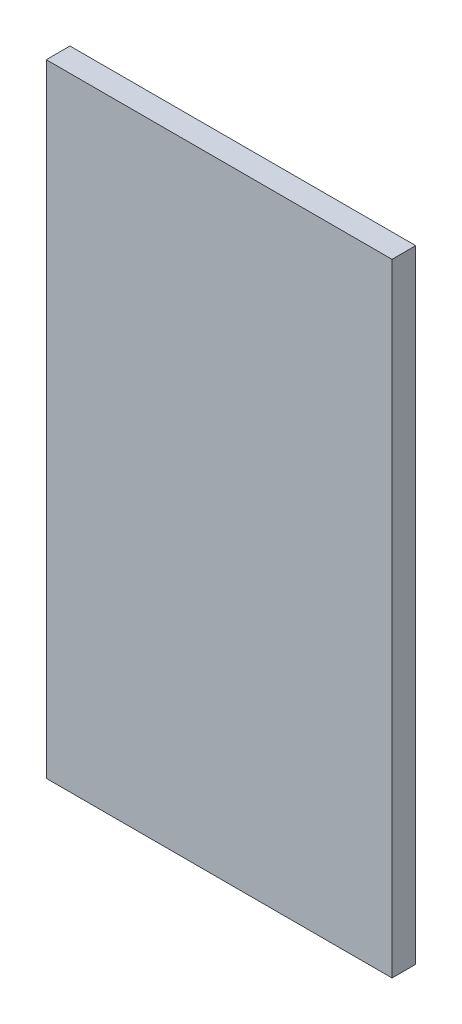
ISO-10303-21;
HEADER;
FILE_DESCRIPTION(('STEP AP214'),'2;1');
FILE_NAME('part.step','',(''),(''),'','','');
FILE_SCHEMA(('AUTOMOTIVE_DESIGN { 1 0 10303 214 1 1 1 1 }'));
ENDSEC;
DATA;
#1=APPLICATION_CONTEXT('core data for automotive mechanical design processes');
#2=APPLICATION_PROTOCOL_DEFINITION('international standard','automotive_design',2000,#1);
#3=PRODUCT_CONTEXT('',#1,'mechanical');
#4=PRODUCT('Part','Part','',(#3));
#5=PRODUCT_RELATED_PRODUCT_CATEGORY('part','',(#4));
#6=PRODUCT_DEFINITION_FORMATION('','',#4);
#7=PRODUCT_DEFINITION_CONTEXT('part definition',#1,'design');
#8=PRODUCT_DEFINITION('design','',#6,#7);
#9=PRODUCT_DEFINITION_SHAPE('','',#8);
#10=(LENGTH_UNIT() NAMED_UNIT(*) SI_UNIT(.MILLI.,.METRE.));
#11=(NAMED_UNIT(*) PLANE_ANGLE_UNIT() SI_UNIT($,.RADIAN.));
#12=(NAMED_UNIT(*) SI_UNIT($,.STERADIAN.) SOLID_ANGLE_UNIT());
#13=UNCERTAINTY_MEASURE_WITH_UNIT(LENGTH_MEASURE(1.E-05),#10,'distance_accuracy_value','');
#14=(GEOMETRIC_REPRESENTATION_CONTEXT(3) GLOBAL_UNCERTAINTY_ASSIGNED_CONTEXT((#13)) GLOBAL_UNIT_ASSIGNED_CONTEXT((#10,
#11,#12)) REPRESENTATION_CONTEXT('',''));
#15=CARTESIAN_POINT('',(0.,0.,0.));
#16=DIRECTION('',(0.,0.,1.));
#17=DIRECTION('',(1.,0.,0.));
#18=AXIS2_PLACEMENT_3D('',#15,#16,#17);
#19=CARTESIAN_POINT('',(5.00008,0.7,0.));
#20=DIRECTION('',(0.,0.,-1.));
#21=DIRECTION('',(-1.,0.,0.));
#22=AXIS2_PLACEMENT_3D('',#19,#20,#21);
#23=PLANE('',#22);
#24=DIRECTION('',(1.,0.,0.));
#25=VECTOR('',#24,1.);
#26=CARTESIAN_POINT('',(4.75008,1.15,0.));
#27=LINE('',#26,#25);
#28=CARTESIAN_POINT('',(4.75008,1.15,0.));
#29=VERTEX_POINT('',#28);
#30=CARTESIAN_POINT('',(5.25008,1.15,0.));
#31=VERTEX_POINT('',#30);
#32=EDGE_CURVE('E55',#29,#31,#27,.T.);
#33=ORIENTED_EDGE('',*,*,#32,.T.);
#34=DIRECTION('',(0.,1.,0.));
#35=VECTOR('',#34,1.);
#36=CARTESIAN_POINT('',(5.25008,1.15,0.));
#37=LINE('',#36,#35);
#38=CARTESIAN_POINT('',(5.25008,0.25,0.));
#39=VERTEX_POINT('',#38);
#40=EDGE_CURVE('E57',#31,#39,#37,.F.);
#41=ORIENTED_EDGE('',*,*,#40,.T.);
#42=DIRECTION('',(1.,0.,0.));
#43=VECTOR('',#42,1.);
#44=CARTESIAN_POINT('',(5.25008,0.25,0.));
#45=LINE('',#44,#43);
#46=CARTESIAN_POINT('',(4.75008,0.25,0.));
#47=VERTEX_POINT('',#46);
#48=EDGE_CURVE('E20',#39,#47,#45,.F.);
#49=ORIENTED_EDGE('',*,*,#48,.T.);
#50=DIRECTION('',(0.,1.,0.));
#51=VECTOR('',#50,1.);
#52=CARTESIAN_POINT('',(4.75008,0.25,0.));
#53=LINE('',#52,#51);
#54=EDGE_CURVE('E80',#47,#29,#53,.T.);
#55=ORIENTED_EDGE('',*,*,#54,.T.);
#56=EDGE_LOOP('',(#33,#41,#49,#55));
#57=FACE_BOUND('',#56,.T.);
#58=ADVANCED_FACE('F17',(#57),#23,.T.);
#59=CARTESIAN_POINT('',(5.25008,0.25,0.));
#60=DIRECTION('',(0.,1.,0.));
#61=DIRECTION('',(0.,0.,1.));
#62=AXIS2_PLACEMENT_3D('',#59,#60,#61);
#63=PLANE('',#62);
#64=DIRECTION('',(0.,0.,-1.));
#65=VECTOR('',#64,1.);
#66=CARTESIAN_POINT('',(4.75008,0.25,0.));
#67=LINE('',#66,#65);
#68=CARTESIAN_POINT('',(4.75008,0.25,0.03429));
#69=VERTEX_POINT('',#68);
#70=EDGE_CURVE('E68',#69,#47,#67,.T.);
#71=ORIENTED_EDGE('',*,*,#70,.T.);
#72=ORIENTED_EDGE('',*,*,#48,.F.);
#73=DIRECTION('',(0.,0.,1.));
#74=VECTOR('',#73,1.);
#75=CARTESIAN_POINT('',(5.25008,0.25,0.));
#76=LINE('',#75,#74);
#77=CARTESIAN_POINT('',(5.25008,0.25,0.03429));
#78=VERTEX_POINT('',#77);
#79=EDGE_CURVE('E63',#39,#78,#76,.T.);
#80=ORIENTED_EDGE('',*,*,#79,.T.);
#81=DIRECTION('',(1.,0.,0.));
#82=VECTOR('',#81,1.);
#83=CARTESIAN_POINT('',(5.00008,0.25,0.03429));
#84=LINE('',#83,#82);
#85=EDGE_CURVE('E83',#69,#78,#84,.T.);
#86=ORIENTED_EDGE('',*,*,#85,.F.);
#87=EDGE_LOOP('',(#71,#72,#80,#86));
#88=FACE_BOUND('',#87,.T.);
#89=ADVANCED_FACE('F65',(#88),#63,.F.);
#90=CARTESIAN_POINT('',(5.25008,1.15,0.));
#91=DIRECTION('',(-1.,0.,0.));
#92=DIRECTION('',(0.,0.,1.));
#93=AXIS2_PLACEMENT_3D('',#90,#91,#92);
#94=PLANE('',#93);
#95=ORIENTED_EDGE('',*,*,#79,.F.);
#96=ORIENTED_EDGE('',*,*,#40,.F.);
#97=DIRECTION('',(0.,0.,-1.));
#98=VECTOR('',#97,1.);
#99=CARTESIAN_POINT('',(5.25008,1.15,0.));
#100=LINE('',#99,#98);
#101=CARTESIAN_POINT('',(5.25008,1.15,0.03429));
#102=VERTEX_POINT('',#101);
#103=EDGE_CURVE('E75',#31,#102,#100,.F.);
#104=ORIENTED_EDGE('',*,*,#103,.T.);
#105=DIRECTION('',(0.,1.,0.));
#106=VECTOR('',#105,1.);
#107=CARTESIAN_POINT('',(5.25008,0.7,0.03429));
#108=LINE('',#107,#106);
#109=EDGE_CURVE('E72',#78,#102,#108,.T.);
#110=ORIENTED_EDGE('',*,*,#109,.F.);
#111=EDGE_LOOP('',(#95,#96,#104,#110));
#112=FACE_BOUND('',#111,.T.);
#113=ADVANCED_FACE('F70',(#112),#94,.F.);
#114=CARTESIAN_POINT('',(4.75008,1.15,0.));
#115=DIRECTION('',(0.,-1.,0.));
#116=DIRECTION('',(0.,0.,-1.));
#117=AXIS2_PLACEMENT_3D('',#114,#115,#116);
#118=PLANE('',#117);
#119=ORIENTED_EDGE('',*,*,#103,.F.);
#120=ORIENTED_EDGE('',*,*,#32,.F.);
#121=DIRECTION('',(0.,0.,-1.));
#122=VECTOR('',#121,1.);
#123=CARTESIAN_POINT('',(4.75008,1.15,0.));
#124=LINE('',#123,#122);
#125=CARTESIAN_POINT('',(4.75008,1.15,0.03429));
#126=VERTEX_POINT('',#125);
#127=EDGE_CURVE('E35',#29,#126,#124,.F.);
#128=ORIENTED_EDGE('',*,*,#127,.T.);
#129=DIRECTION('',(1.,0.,0.));
#130=VECTOR('',#129,1.);
#131=CARTESIAN_POINT('',(5.00008,1.15,0.03429));
#132=LINE('',#131,#130);
#133=EDGE_CURVE('E26',#102,#126,#132,.F.);
#134=ORIENTED_EDGE('',*,*,#133,.F.);
#135=EDGE_LOOP('',(#119,#120,#128,#134));
#136=FACE_BOUND('',#135,.T.);
#137=ADVANCED_FACE('F89',(#136),#118,.F.);
#138=CARTESIAN_POINT('',(4.75008,0.25,0.));
#139=DIRECTION('',(1.,0.,0.));
#140=DIRECTION('',(0.,0.,-1.));
#141=AXIS2_PLACEMENT_3D('',#138,#139,#140);
#142=PLANE('',#141);
#143=ORIENTED_EDGE('',*,*,#127,.F.);
#144=ORIENTED_EDGE('',*,*,#54,.F.);
#145=ORIENTED_EDGE('',*,*,#70,.F.);
#146=DIRECTION('',(0.,1.,0.));
#147=VECTOR('',#146,1.);
#148=CARTESIAN_POINT('',(4.75008,0.7,0.03429));
#149=LINE('',#148,#147);
#150=EDGE_CURVE('E11',#126,#69,#149,.F.);
#151=ORIENTED_EDGE('',*,*,#150,.F.);
#152=EDGE_LOOP('',(#143,#144,#145,#151));
#153=FACE_BOUND('',#152,.T.);
#154=ADVANCED_FACE('F91',(#153),#142,.F.);
#155=CARTESIAN_POINT('',(5.00008,0.7,0.03429));
#156=DIRECTION('',(0.,0.,1.));
#157=DIRECTION('',(1.,0.,0.));
#158=AXIS2_PLACEMENT_3D('',#155,#156,#157);
#159=PLANE('',#158);
#160=ORIENTED_EDGE('',*,*,#133,.T.);
#161=ORIENTED_EDGE('',*,*,#150,.T.);
#162=ORIENTED_EDGE('',*,*,#85,.T.);
#163=ORIENTED_EDGE('',*,*,#109,.T.);
#164=EDGE_LOOP('',(#160,#161,#162,#163));
#165=FACE_BOUND('',#164,.T.);
#166=ADVANCED_FACE('F88',(#165),#159,.T.);
#167=CLOSED_SHELL('',(#58,#89,#113,#137,#154,#166));
#168=MANIFOLD_SOLID_BREP('B1',#167);
#169=ADVANCED_BREP_SHAPE_REPRESENTATION('',(#18,#168),#14);
#170=SHAPE_DEFINITION_REPRESENTATION(#9,#169);
ENDSEC;
END-ISO-10303-21;
